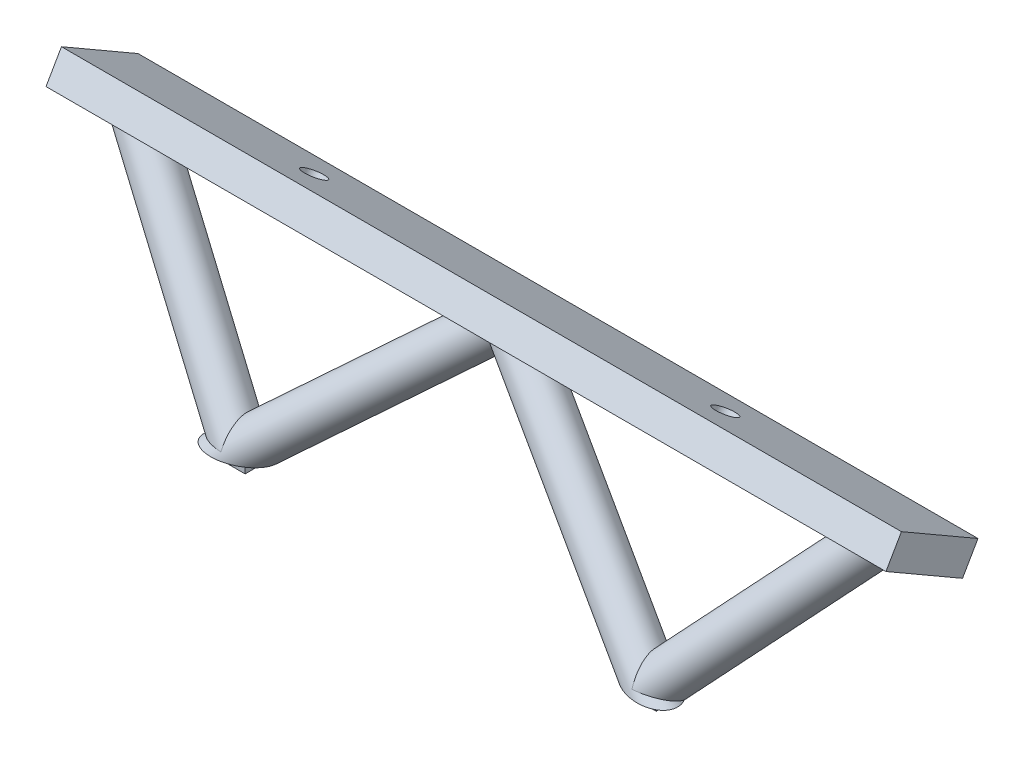
ISO-10303-21;
HEADER;
FILE_DESCRIPTION(('STEP AP214'),'2;1');
FILE_NAME('part.step','',(''),(''),'','','');
FILE_SCHEMA(('AUTOMOTIVE_DESIGN { 1 0 10303 214 1 1 1 1 }'));
ENDSEC;
DATA;
#1=APPLICATION_CONTEXT('core data for automotive mechanical design processes');
#2=APPLICATION_PROTOCOL_DEFINITION('international standard','automotive_design',2000,#1);
#3=PRODUCT_CONTEXT('',#1,'mechanical');
#4=PRODUCT('Part','Part','',(#3));
#5=PRODUCT_RELATED_PRODUCT_CATEGORY('part','',(#4));
#6=PRODUCT_DEFINITION_FORMATION('','',#4);
#7=PRODUCT_DEFINITION_CONTEXT('part definition',#1,'design');
#8=PRODUCT_DEFINITION('design','',#6,#7);
#9=PRODUCT_DEFINITION_SHAPE('','',#8);
#10=(LENGTH_UNIT() NAMED_UNIT(*) SI_UNIT(.MILLI.,.METRE.));
#11=(NAMED_UNIT(*) PLANE_ANGLE_UNIT() SI_UNIT($,.RADIAN.));
#12=(NAMED_UNIT(*) SI_UNIT($,.STERADIAN.) SOLID_ANGLE_UNIT());
#13=UNCERTAINTY_MEASURE_WITH_UNIT(LENGTH_MEASURE(1.E-05),#10,'distance_accuracy_value','');
#14=(GEOMETRIC_REPRESENTATION_CONTEXT(3) GLOBAL_UNCERTAINTY_ASSIGNED_CONTEXT((#13)) GLOBAL_UNIT_ASSIGNED_CONTEXT((#10,
#11,#12)) REPRESENTATION_CONTEXT('',''));
#15=CARTESIAN_POINT('',(0.,0.,0.));
#16=DIRECTION('',(0.,0.,1.));
#17=DIRECTION('',(1.,0.,0.));
#18=AXIS2_PLACEMENT_3D('',#15,#16,#17);
#19=CARTESIAN_POINT('',(58.,55.2139289628746,53.));
#20=DIRECTION('',(0.,1.,0.));
#21=DIRECTION('',(-1.,0.,0.));
#22=AXIS2_PLACEMENT_3D('',#19,#20,#21);
#23=PLANE('',#22);
#24=CARTESIAN_POINT('',(46.5,55.2139289628746,43.));
#25=DIRECTION('',(0.,1.,0.));
#26=DIRECTION('',(-0.953957033947419,0.,-0.299943290277083));
#27=AXIS2_PLACEMENT_3D('',#24,#25,#26);
#28=ELLIPSE('',#27,7.27687672687006,4.74999999999999);
#29=CARTESIAN_POINT('',(46.4242656035113,55.2139289628746,38.1095741940705));
#30=VERTEX_POINT('',#29);
#31=CARTESIAN_POINT('',(52.9386609054862,55.2139289628746,42.0774517850268));
#32=VERTEX_POINT('',#31);
#33=EDGE_CURVE('E204',#30,#32,#28,.T.);
#34=ORIENTED_EDGE('',*,*,#33,.F.);
#35=CARTESIAN_POINT('',(46.5,55.2139289628746,43.));
#36=DIRECTION('',(0.,1.,0.));
#37=DIRECTION('',(0.934859867697559,0.,-0.355016940114838));
#38=AXIS2_PLACEMENT_3D('',#35,#36,#37);
#39=ELLIPSE('',#38,6.65247116038743,4.74999999999999);
#40=EDGE_CURVE('E245',#32,#30,#39,.T.);
#41=ORIENTED_EDGE('',*,*,#40,.F.);
#42=EDGE_LOOP('',(#34,#41));
#43=FACE_BOUND('',#42,.T.);
#44=DIRECTION('',(0.,0.,1.));
#45=VECTOR('',#44,1.);
#46=CARTESIAN_POINT('',(49.,55.2139289628746,44.5));
#47=LINE('',#46,#45);
#48=CARTESIAN_POINT('',(49.,55.2139289628746,41.5));
#49=VERTEX_POINT('',#48);
#50=CARTESIAN_POINT('',(49.,55.2139289628746,44.5));
#51=VERTEX_POINT('',#50);
#52=EDGE_CURVE('E49',#49,#51,#47,.T.);
#53=ORIENTED_EDGE('',*,*,#52,.F.);
#54=DIRECTION('',(1.,0.,0.));
#55=VECTOR('',#54,1.);
#56=CARTESIAN_POINT('',(44.,55.2139289628746,41.5));
#57=LINE('',#56,#55);
#58=CARTESIAN_POINT('',(44.,55.2139289628746,41.5));
#59=VERTEX_POINT('',#58);
#60=EDGE_CURVE('E53',#59,#49,#57,.T.);
#61=ORIENTED_EDGE('',*,*,#60,.F.);
#62=DIRECTION('',(0.,0.,-1.));
#63=VECTOR('',#62,1.);
#64=CARTESIAN_POINT('',(44.,55.2139289628746,44.5));
#65=LINE('',#64,#63);
#66=CARTESIAN_POINT('',(44.,55.2139289628746,44.5));
#67=VERTEX_POINT('',#66);
#68=EDGE_CURVE('E584',#67,#59,#65,.T.);
#69=ORIENTED_EDGE('',*,*,#68,.F.);
#70=DIRECTION('',(-1.,0.,0.));
#71=VECTOR('',#70,1.);
#72=CARTESIAN_POINT('',(44.,55.2139289628746,44.5));
#73=LINE('',#72,#71);
#74=EDGE_CURVE('E586',#51,#67,#73,.T.);
#75=ORIENTED_EDGE('',*,*,#74,.F.);
#76=EDGE_LOOP('',(#53,#61,#69,#75));
#77=FACE_BOUND('',#76,.T.);
#78=ADVANCED_FACE('F34',(#43,#77),#23,.F.);
#79=CARTESIAN_POINT('',(-46.5,55.2139289628746,43.));
#80=DIRECTION('',(0.,1.,0.));
#81=DIRECTION('',(0.953957033947419,0.,-0.299943290277083));
#82=AXIS2_PLACEMENT_3D('',#79,#80,#81);
#83=ELLIPSE('',#82,7.27687672687007,4.75);
#84=CARTESIAN_POINT('',(-52.9386609054863,55.2139289628746,42.0774517850268));
#85=VERTEX_POINT('',#84);
#86=CARTESIAN_POINT('',(-46.4242656035112,55.2139289628746,38.1095741940705));
#87=VERTEX_POINT('',#86);
#88=EDGE_CURVE('E211',#85,#87,#83,.T.);
#89=ORIENTED_EDGE('',*,*,#88,.F.);
#90=CARTESIAN_POINT('',(-46.5,55.2139289628746,43.));
#91=DIRECTION('',(0.,1.,0.));
#92=DIRECTION('',(-0.93485986769756,0.,-0.355016940114836));
#93=AXIS2_PLACEMENT_3D('',#90,#91,#92);
#94=ELLIPSE('',#93,6.65247116038745,4.75);
#95=EDGE_CURVE('E224',#87,#85,#94,.T.);
#96=ORIENTED_EDGE('',*,*,#95,.F.);
#97=EDGE_LOOP('',(#89,#96));
#98=FACE_BOUND('',#97,.T.);
#99=DIRECTION('',(0.,0.,1.));
#100=VECTOR('',#99,1.);
#101=CARTESIAN_POINT('',(-44.,55.2139289628746,44.5));
#102=LINE('',#101,#100);
#103=CARTESIAN_POINT('',(-44.,55.2139289628746,41.5));
#104=VERTEX_POINT('',#103);
#105=CARTESIAN_POINT('',(-44.,55.2139289628746,44.5));
#106=VERTEX_POINT('',#105);
#107=EDGE_CURVE('E166',#104,#106,#102,.T.);
#108=ORIENTED_EDGE('',*,*,#107,.F.);
#109=DIRECTION('',(1.,0.,0.));
#110=VECTOR('',#109,1.);
#111=CARTESIAN_POINT('',(-49.,55.2139289628746,41.5));
#112=LINE('',#111,#110);
#113=CARTESIAN_POINT('',(-49.,55.2139289628746,41.5));
#114=VERTEX_POINT('',#113);
#115=EDGE_CURVE('E179',#114,#104,#112,.T.);
#116=ORIENTED_EDGE('',*,*,#115,.F.);
#117=DIRECTION('',(0.,0.,-1.));
#118=VECTOR('',#117,1.);
#119=CARTESIAN_POINT('',(-49.,55.2139289628746,44.5));
#120=LINE('',#119,#118);
#121=CARTESIAN_POINT('',(-49.,55.2139289628746,44.5));
#122=VERTEX_POINT('',#121);
#123=EDGE_CURVE('E188',#122,#114,#120,.T.);
#124=ORIENTED_EDGE('',*,*,#123,.F.);
#125=DIRECTION('',(-1.,0.,0.));
#126=VECTOR('',#125,1.);
#127=CARTESIAN_POINT('',(-49.,55.2139289628746,44.5));
#128=LINE('',#127,#126);
#129=EDGE_CURVE('E169',#106,#122,#128,.T.);
#130=ORIENTED_EDGE('',*,*,#129,.F.);
#131=EDGE_LOOP('',(#108,#116,#124,#130));
#132=FACE_BOUND('',#131,.T.);
#133=ADVANCED_FACE('F317',(#98,#132),#23,.F.);
#134=CARTESIAN_POINT('',(0.,64.0858798800484,-37.0000000000001));
#135=DIRECTION('',(0.,0.866025403784438,-0.500000000000001));
#136=DIRECTION('',(0.,0.500000000000001,0.866025403784438));
#137=AXIS2_PLACEMENT_3D('',#134,#135,#136);
#138=PLANE('',#137);
#139=CARTESIAN_POINT('',(-46.5,100.678030578012,26.3794641670904));
#140=DIRECTION('',(0.,0.866025403784438,-0.500000000000001));
#141=DIRECTION('',(0.,0.500000000000001,0.866025403784438));
#142=AXIS2_PLACEMENT_3D('',#139,#140,#141);
#143=CIRCLE('',#142,2.50000000000001);
#144=CARTESIAN_POINT('',(-46.5,101.928030578012,28.5445276765515));
#145=VERTEX_POINT('',#144);
#146=EDGE_CURVE('E603',#145,#145,#143,.F.);
#147=ORIENTED_EDGE('',*,*,#146,.T.);
#148=EDGE_LOOP('',(#147));
#149=FACE_BOUND('',#148,.T.);
#150=CARTESIAN_POINT('',(46.5,100.678030578012,26.3794641670904));
#151=DIRECTION('',(0.,0.866025403784438,-0.500000000000001));
#152=DIRECTION('',(0.,0.500000000000001,0.866025403784438));
#153=AXIS2_PLACEMENT_3D('',#150,#151,#152);
#154=CIRCLE('',#153,2.50000000000001);
#155=CARTESIAN_POINT('',(46.5,101.928030578012,28.5445276765515));
#156=VERTEX_POINT('',#155);
#157=EDGE_CURVE('E597',#156,#156,#154,.F.);
#158=ORIENTED_EDGE('',*,*,#157,.T.);
#159=EDGE_LOOP('',(#158));
#160=FACE_BOUND('',#159,.T.);
#161=DIRECTION('',(1.,0.,0.));
#162=VECTOR('',#161,1.);
#163=CARTESIAN_POINT('',(0.,95.6780305780125,17.719210129246));
#164=LINE('',#163,#162);
#165=CARTESIAN_POINT('',(-95.,95.6780305780125,17.719210129246));
#166=VERTEX_POINT('',#165);
#167=CARTESIAN_POINT('',(95.,95.6780305780125,17.719210129246));
#168=VERTEX_POINT('',#167);
#169=EDGE_CURVE('E260',#166,#168,#164,.T.);
#170=ORIENTED_EDGE('',*,*,#169,.F.);
#171=DIRECTION('',(0.,0.500000000000001,0.866025403784438));
#172=VECTOR('',#171,1.);
#173=CARTESIAN_POINT('',(-95.,64.0858798800484,-37.0000000000001));
#174=LINE('',#173,#172);
#175=CARTESIAN_POINT('',(-95.0000000000001,105.678030578012,35.0397182049348));
#176=VERTEX_POINT('',#175);
#177=EDGE_CURVE('E230',#166,#176,#174,.T.);
#178=ORIENTED_EDGE('',*,*,#177,.T.);
#179=DIRECTION('',(1.,0.,0.));
#180=VECTOR('',#179,1.);
#181=CARTESIAN_POINT('',(0.,105.678030578012,35.0397182049348));
#182=LINE('',#181,#180);
#183=CARTESIAN_POINT('',(95.,105.678030578012,35.0397182049348));
#184=VERTEX_POINT('',#183);
#185=EDGE_CURVE('E254',#176,#184,#182,.T.);
#186=ORIENTED_EDGE('',*,*,#185,.T.);
#187=DIRECTION('',(0.,0.500000000000001,0.866025403784438));
#188=VECTOR('',#187,1.);
#189=CARTESIAN_POINT('',(95.,64.0858798800484,-37.0000000000001));
#190=LINE('',#189,#188);
#191=EDGE_CURVE('E257',#168,#184,#190,.T.);
#192=ORIENTED_EDGE('',*,*,#191,.F.);
#193=EDGE_LOOP('',(#170,#178,#186,#192));
#194=FACE_BOUND('',#193,.T.);
#195=ADVANCED_FACE('F279',(#149,#160,#194),#138,.T.);
#196=CARTESIAN_POINT('',(95.,58.0237020535574,-33.5000000000001));
#197=DIRECTION('',(-1.,0.,0.));
#198=DIRECTION('',(0.,0.,1.));
#199=AXIS2_PLACEMENT_3D('',#196,#197,#198);
#200=PLANE('',#199);
#201=DIRECTION('',(0.,0.866025403784438,-0.500000000000001));
#202=VECTOR('',#201,1.);
#203=CARTESIAN_POINT('',(95.,89.6158527515214,21.2192101292461));
#204=LINE('',#203,#202);
#205=CARTESIAN_POINT('',(95.,89.6158527515214,21.2192101292461));
#206=VERTEX_POINT('',#205);
#207=EDGE_CURVE('E11',#206,#168,#204,.T.);
#208=ORIENTED_EDGE('',*,*,#207,.T.);
#209=ORIENTED_EDGE('',*,*,#191,.T.);
#210=DIRECTION('',(0.,0.866025403784438,-0.500000000000001));
#211=VECTOR('',#210,1.);
#212=CARTESIAN_POINT('',(95.,99.6158527515214,38.5397182049348));
#213=LINE('',#212,#211);
#214=CARTESIAN_POINT('',(95.,99.6158527515214,38.5397182049348));
#215=VERTEX_POINT('',#214);
#216=EDGE_CURVE('E38',#215,#184,#213,.T.);
#217=ORIENTED_EDGE('',*,*,#216,.F.);
#218=DIRECTION('',(0.,0.500000000000001,0.866025403784438));
#219=VECTOR('',#218,1.);
#220=CARTESIAN_POINT('',(95.,58.0237020535574,-33.5000000000001));
#221=LINE('',#220,#219);
#222=EDGE_CURVE('E266',#206,#215,#221,.T.);
#223=ORIENTED_EDGE('',*,*,#222,.F.);
#224=EDGE_LOOP('',(#208,#209,#217,#223));
#225=FACE_BOUND('',#224,.T.);
#226=ADVANCED_FACE('F281',(#225),#200,.F.);
#227=CARTESIAN_POINT('',(0.,89.6158527515214,21.2192101292461));
#228=DIRECTION('',(0.,0.500000000000001,0.866025403784438));
#229=DIRECTION('',(0.,-0.866025403784438,0.500000000000001));
#230=AXIS2_PLACEMENT_3D('',#227,#228,#229);
#231=PLANE('',#230);
#232=DIRECTION('',(1.,0.,0.));
#233=VECTOR('',#232,1.);
#234=CARTESIAN_POINT('',(0.,89.6158527515214,21.2192101292461));
#235=LINE('',#234,#233);
#236=CARTESIAN_POINT('',(-95.,89.6158527515214,21.2192101292461));
#237=VERTEX_POINT('',#236);
#238=EDGE_CURVE('E268',#237,#206,#235,.T.);
#239=ORIENTED_EDGE('',*,*,#238,.F.);
#240=DIRECTION('',(0.,0.866025403784438,-0.500000000000001));
#241=VECTOR('',#240,1.);
#242=CARTESIAN_POINT('',(-95.,89.6158527515214,21.2192101292461));
#243=LINE('',#242,#241);
#244=EDGE_CURVE('E236',#237,#166,#243,.T.);
#245=ORIENTED_EDGE('',*,*,#244,.T.);
#246=ORIENTED_EDGE('',*,*,#169,.T.);
#247=ORIENTED_EDGE('',*,*,#207,.F.);
#248=EDGE_LOOP('',(#239,#245,#246,#247));
#249=FACE_BOUND('',#248,.T.);
#250=ADVANCED_FACE('F283',(#249),#231,.F.);
#251=CARTESIAN_POINT('',(-95.,58.0237020535573,-33.5000000000001));
#252=DIRECTION('',(-1.,0.,0.));
#253=DIRECTION('',(0.,0.,1.));
#254=AXIS2_PLACEMENT_3D('',#251,#252,#253);
#255=PLANE('',#254);
#256=DIRECTION('',(0.,0.866025403784438,-0.500000000000001));
#257=VECTOR('',#256,1.);
#258=CARTESIAN_POINT('',(-95.0000000000001,99.6158527515214,38.5397182049348));
#259=LINE('',#258,#257);
#260=CARTESIAN_POINT('',(-95.0000000000001,99.6158527515214,38.5397182049348));
#261=VERTEX_POINT('',#260);
#262=EDGE_CURVE('E237',#261,#176,#259,.T.);
#263=ORIENTED_EDGE('',*,*,#262,.T.);
#264=ORIENTED_EDGE('',*,*,#177,.F.);
#265=ORIENTED_EDGE('',*,*,#244,.F.);
#266=DIRECTION('',(0.,0.500000000000001,0.866025403784438));
#267=VECTOR('',#266,1.);
#268=CARTESIAN_POINT('',(-95.,58.0237020535573,-33.5000000000001));
#269=LINE('',#268,#267);
#270=EDGE_CURVE('E233',#237,#261,#269,.T.);
#271=ORIENTED_EDGE('',*,*,#270,.T.);
#272=EDGE_LOOP('',(#263,#264,#265,#271));
#273=FACE_BOUND('',#272,.T.);
#274=ADVANCED_FACE('F286',(#273),#255,.T.);
#275=CARTESIAN_POINT('',(0.,99.6158527515214,38.5397182049348));
#276=DIRECTION('',(0.,0.500000000000001,0.866025403784438));
#277=DIRECTION('',(0.,-0.866025403784438,0.500000000000001));
#278=AXIS2_PLACEMENT_3D('',#275,#276,#277);
#279=PLANE('',#278);
#280=ORIENTED_EDGE('',*,*,#216,.T.);
#281=ORIENTED_EDGE('',*,*,#185,.F.);
#282=ORIENTED_EDGE('',*,*,#262,.F.);
#283=DIRECTION('',(1.,0.,0.));
#284=VECTOR('',#283,1.);
#285=CARTESIAN_POINT('',(0.,99.6158527515214,38.5397182049348));
#286=LINE('',#285,#284);
#287=EDGE_CURVE('E263',#261,#215,#286,.T.);
#288=ORIENTED_EDGE('',*,*,#287,.T.);
#289=EDGE_LOOP('',(#280,#281,#282,#288));
#290=FACE_BOUND('',#289,.T.);
#291=ADVANCED_FACE('F36',(#290),#279,.T.);
#292=CARTESIAN_POINT('',(0.,58.0237020535574,-33.5000000000001));
#293=DIRECTION('',(0.,0.866025403784438,-0.500000000000001));
#294=DIRECTION('',(0.,0.500000000000001,0.866025403784438));
#295=AXIS2_PLACEMENT_3D('',#292,#293,#294);
#296=PLANE('',#295);
#297=CARTESIAN_POINT('',(-46.5,94.6158527515214,29.8794641670904));
#298=DIRECTION('',(0.,-0.866025403784438,0.500000000000001));
#299=DIRECTION('',(0.,-0.500000000000001,-0.866025403784438));
#300=AXIS2_PLACEMENT_3D('',#297,#298,#299);
#301=CIRCLE('',#300,2.50000000000001);
#302=CARTESIAN_POINT('',(-46.5,93.3658527515214,27.7144006576293));
#303=VERTEX_POINT('',#302);
#304=EDGE_CURVE('E594',#303,#303,#301,.T.);
#305=ORIENTED_EDGE('',*,*,#304,.F.);
#306=EDGE_LOOP('',(#305));
#307=FACE_BOUND('',#306,.T.);
#308=CARTESIAN_POINT('',(46.5,94.6158527515214,29.8794641670904));
#309=DIRECTION('',(0.,-0.866025403784438,0.500000000000001));
#310=DIRECTION('',(0.,-0.500000000000001,-0.866025403784438));
#311=AXIS2_PLACEMENT_3D('',#308,#309,#310);
#312=CIRCLE('',#311,2.50000000000001);
#313=CARTESIAN_POINT('',(46.5,93.3658527515214,27.7144006576293));
#314=VERTEX_POINT('',#313);
#315=EDGE_CURVE('E600',#314,#314,#312,.T.);
#316=ORIENTED_EDGE('',*,*,#315,.F.);
#317=EDGE_LOOP('',(#316));
#318=FACE_BOUND('',#317,.T.);
#319=CARTESIAN_POINT('',(82.3559710967707,94.3295337957156,29.3835451884648));
#320=DIRECTION('',(0.,0.866025403784438,-0.500000000000001));
#321=DIRECTION('',(-0.977341114798957,-0.105835184749133,-0.183311917213937));
#322=AXIS2_PLACEMENT_3D('',#319,#320,#321);
#323=ELLIPSE('',#322,6.39611855489561,4.74999999999999);
#324=CARTESIAN_POINT('',(76.1047814579428,93.6525994067809,28.2110604334392));
#325=VERTEX_POINT('',#324);
#326=EDGE_CURVE('E251',#325,#325,#323,.F.);
#327=ORIENTED_EDGE('',*,*,#326,.F.);
#328=EDGE_LOOP('',(#327));
#329=FACE_BOUND('',#328,.T.);
#330=ORIENTED_EDGE('',*,*,#287,.F.);
#331=ORIENTED_EDGE('',*,*,#270,.F.);
#332=ORIENTED_EDGE('',*,*,#238,.T.);
#333=ORIENTED_EDGE('',*,*,#222,.T.);
#334=EDGE_LOOP('',(#330,#331,#332,#333));
#335=FACE_BOUND('',#334,.T.);
#336=CARTESIAN_POINT('',(-82.3559710967709,94.3295337957156,29.3835451884648));
#337=DIRECTION('',(0.,0.866025403784438,-0.500000000000001));
#338=DIRECTION('',(0.977341114798957,-0.105835184749133,-0.183311917213937));
#339=AXIS2_PLACEMENT_3D('',#336,#337,#338);
#340=ELLIPSE('',#339,6.39611855489563,4.75);
#341=CARTESIAN_POINT('',(-76.1047814579429,93.6525994067809,28.2110604334392));
#342=VERTEX_POINT('',#341);
#343=EDGE_CURVE('E227',#342,#342,#340,.F.);
#344=ORIENTED_EDGE('',*,*,#343,.F.);
#345=EDGE_LOOP('',(#344));
#346=FACE_BOUND('',#345,.T.);
#347=CARTESIAN_POINT('',(3.19343750649756,94.3295337957156,29.3835451884647));
#348=DIRECTION('',(0.,0.866025403784438,-0.500000000000001));
#349=DIRECTION('',(0.984300305855036,-0.0882509318558194,-0.152855097789578));
#350=AXIS2_PLACEMENT_3D('',#347,#348,#349);
#351=ELLIPSE('',#350,6.99646268766552,4.74999999999999);
#352=CARTESIAN_POINT('',(0.,92.3552803187094,25.9640378592704));
#353=VERTEX_POINT('',#352);
#354=CARTESIAN_POINT('',(1.38561037643647E-13,96.6079738023079,33.3299190418801));
#355=VERTEX_POINT('',#354);
#356=EDGE_CURVE('E207',#353,#355,#351,.F.);
#357=ORIENTED_EDGE('',*,*,#356,.F.);
#358=CARTESIAN_POINT('',(-3.19343750649758,94.3295337957156,29.3835451884648));
#359=DIRECTION('',(0.,0.866025403784438,-0.500000000000001));
#360=DIRECTION('',(-0.984300305855036,-0.0882509318558198,-0.152855097789578));
#361=AXIS2_PLACEMENT_3D('',#358,#359,#360);
#362=ELLIPSE('',#361,6.99646268766554,4.75);
#363=EDGE_CURVE('E210',#355,#353,#362,.F.);
#364=ORIENTED_EDGE('',*,*,#363,.F.);
#365=EDGE_LOOP('',(#357,#364));
#366=FACE_BOUND('',#365,.T.);
#367=ADVANCED_FACE('F287',(#307,#318,#329,#335,#346,#366),#296,.F.);
#368=CARTESIAN_POINT('',(92.1573453599017,105.021942082768,25.6614323670138));
#369=DIRECTION('',(-0.654518683612461,-0.714020382122688,0.248556204339345));
#370=DIRECTION('',(0.737154140200743,-0.675724628517345,0.));
#371=AXIS2_PLACEMENT_3D('',#368,#369,#370);
#372=CYLINDRICAL_SURFACE('',#371,4.74999999999999);
#373=ORIENTED_EDGE('',*,*,#326,.T.);
#374=EDGE_LOOP('',(#373));
#375=FACE_BOUND('',#374,.T.);
#376=ORIENTED_EDGE('',*,*,#40,.T.);
#377=CARTESIAN_POINT('',(46.5,55.2139289628746,43.));
#378=DIRECTION('',(0.998892387096748,0.0444376617209511,-0.0154691053695681));
#379=DIRECTION('',(-0.0470531507995,0.943368111151235,-0.328393982683591));
#380=AXIS2_PLACEMENT_3D('',#377,#378,#379);
#381=ELLIPSE('',#380,6.89036846413452,4.74999999999999);
#382=CARTESIAN_POINT('',(46.5,56.7755300301135,47.4859672431705));
#383=VERTEX_POINT('',#382);
#384=EDGE_CURVE('E248',#30,#383,#381,.T.);
#385=ORIENTED_EDGE('',*,*,#384,.T.);
#386=CARTESIAN_POINT('',(46.5,55.2139289628746,43.));
#387=DIRECTION('',(-0.0470531507995,0.943368111151235,-0.328393982683591));
#388=DIRECTION('',(0.998892387096748,0.0444376617209511,-0.0154691053695681));
#389=AXIS2_PLACEMENT_3D('',#386,#387,#388);
#390=ELLIPSE('',#389,6.55704887087197,4.74999999999999);
#391=EDGE_CURVE('E240',#383,#32,#390,.T.);
#392=ORIENTED_EDGE('',*,*,#391,.T.);
#393=EDGE_LOOP('',(#376,#385,#392));
#394=FACE_BOUND('',#393,.T.);
#395=ADVANCED_FACE('F290',(#375,#394),#372,.T.);
#396=CARTESIAN_POINT('',(-8.12337828683931,104.551173867117,25.8253105471546));
#397=DIRECTION('',(0.722690347633596,-0.652752572056153,0.227228389756449));
#398=DIRECTION('',(0.670286257968771,0.742102642751138,0.));
#399=AXIS2_PLACEMENT_3D('',#396,#397,#398);
#400=CYLINDRICAL_SURFACE('',#399,4.74999999999999);
#401=ORIENTED_EDGE('',*,*,#33,.T.);
#402=ORIENTED_EDGE('',*,*,#391,.F.);
#403=ORIENTED_EDGE('',*,*,#384,.F.);
#404=EDGE_LOOP('',(#401,#402,#403));
#405=FACE_BOUND('',#404,.T.);
#406=CARTESIAN_POINT('',(0.,97.2139289628747,28.3794641670904));
#407=DIRECTION('',(-1.,0.,0.));
#408=DIRECTION('',(0.,-0.94441415645694,0.328758119418708));
#409=AXIS2_PLACEMENT_3D('',#406,#407,#408);
#410=ELLIPSE('',#409,6.5726628500762,4.75);
#411=EDGE_CURVE('E215',#355,#353,#410,.F.);
#412=ORIENTED_EDGE('',*,*,#411,.T.);
#413=ORIENTED_EDGE('',*,*,#356,.T.);
#414=EDGE_LOOP('',(#412,#413));
#415=FACE_BOUND('',#414,.T.);
#416=ADVANCED_FACE('F298',(#405,#415),#400,.T.);
#417=CARTESIAN_POINT('',(-92.1573453599018,105.021942082768,25.6614323670138));
#418=DIRECTION('',(0.654518683612462,-0.714020382122687,0.248556204339344));
#419=DIRECTION('',(0.737154140200742,0.675724628517346,0.));
#420=AXIS2_PLACEMENT_3D('',#417,#418,#419);
#421=CYLINDRICAL_SURFACE('',#420,4.75);
#422=ORIENTED_EDGE('',*,*,#343,.T.);
#423=EDGE_LOOP('',(#422));
#424=FACE_BOUND('',#423,.T.);
#425=CARTESIAN_POINT('',(-46.5,55.2139289628746,43.));
#426=DIRECTION('',(0.0470531507994994,0.943368111151235,-0.32839398268359));
#427=DIRECTION('',(-0.998892387096748,0.0444376617209503,-0.0154691053695679));
#428=AXIS2_PLACEMENT_3D('',#425,#426,#427);
#429=ELLIPSE('',#428,6.55704887087199,4.75);
#430=CARTESIAN_POINT('',(-46.5,56.7755300301135,47.4859672431705));
#431=VERTEX_POINT('',#430);
#432=EDGE_CURVE('E221',#85,#431,#429,.T.);
#433=ORIENTED_EDGE('',*,*,#432,.T.);
#434=CARTESIAN_POINT('',(-46.5,55.2139289628746,43.));
#435=DIRECTION('',(-0.998892387096748,0.0444376617209503,-0.0154691053695679));
#436=DIRECTION('',(0.0470531507994994,0.943368111151235,-0.32839398268359));
#437=AXIS2_PLACEMENT_3D('',#434,#435,#436);
#438=ELLIPSE('',#437,6.89036846413453,4.75);
#439=EDGE_CURVE('E214',#431,#87,#438,.T.);
#440=ORIENTED_EDGE('',*,*,#439,.T.);
#441=ORIENTED_EDGE('',*,*,#95,.T.);
#442=EDGE_LOOP('',(#433,#440,#441));
#443=FACE_BOUND('',#442,.T.);
#444=ADVANCED_FACE('F303',(#424,#443),#421,.T.);
#445=CARTESIAN_POINT('',(23.5321547775089,118.468778439334,20.9804811100982));
#446=DIRECTION('',(-0.722690347633596,-0.652752572056153,0.227228389756448));
#447=DIRECTION('',(0.670286257968771,-0.742102642751138,0.));
#448=AXIS2_PLACEMENT_3D('',#445,#446,#447);
#449=CYLINDRICAL_SURFACE('',#448,4.75);
#450=ORIENTED_EDGE('',*,*,#439,.F.);
#451=ORIENTED_EDGE('',*,*,#432,.F.);
#452=ORIENTED_EDGE('',*,*,#88,.T.);
#453=EDGE_LOOP('',(#450,#451,#452));
#454=FACE_BOUND('',#453,.T.);
#455=ORIENTED_EDGE('',*,*,#363,.T.);
#456=ORIENTED_EDGE('',*,*,#411,.F.);
#457=EDGE_LOOP('',(#455,#456));
#458=FACE_BOUND('',#457,.T.);
#459=ADVANCED_FACE('F300',(#454,#458),#449,.T.);
#460=CARTESIAN_POINT('',(-44.,52.2139289628746,44.5));
#461=DIRECTION('',(-1.,0.,0.));
#462=DIRECTION('',(0.,-1.,0.));
#463=AXIS2_PLACEMENT_3D('',#460,#461,#462);
#464=PLANE('',#463);
#465=ORIENTED_EDGE('',*,*,#107,.T.);
#466=DIRECTION('',(0.,1.,0.));
#467=VECTOR('',#466,1.);
#468=CARTESIAN_POINT('',(-44.,52.2139289628746,44.5));
#469=LINE('',#468,#467);
#470=CARTESIAN_POINT('',(-44.,52.2139289628746,44.5));
#471=VERTEX_POINT('',#470);
#472=EDGE_CURVE('E201',#471,#106,#469,.T.);
#473=ORIENTED_EDGE('',*,*,#472,.F.);
#474=DIRECTION('',(0.,0.,1.));
#475=VECTOR('',#474,1.);
#476=CARTESIAN_POINT('',(-44.,52.2139289628746,44.5));
#477=LINE('',#476,#475);
#478=CARTESIAN_POINT('',(-44.,52.2139289628746,41.5));
#479=VERTEX_POINT('',#478);
#480=EDGE_CURVE('E175',#479,#471,#477,.T.);
#481=ORIENTED_EDGE('',*,*,#480,.F.);
#482=DIRECTION('',(0.,1.,0.));
#483=VECTOR('',#482,1.);
#484=CARTESIAN_POINT('',(-44.,52.2139289628746,41.5));
#485=LINE('',#484,#483);
#486=EDGE_CURVE('E184',#479,#104,#485,.T.);
#487=ORIENTED_EDGE('',*,*,#486,.T.);
#488=EDGE_LOOP('',(#465,#473,#481,#487));
#489=FACE_BOUND('',#488,.T.);
#490=ADVANCED_FACE('F302',(#489),#464,.F.);
#491=CARTESIAN_POINT('',(-49.,52.2139289628746,44.5));
#492=DIRECTION('',(0.,0.,-1.));
#493=DIRECTION('',(0.,1.,0.));
#494=AXIS2_PLACEMENT_3D('',#491,#492,#493);
#495=PLANE('',#494);
#496=ORIENTED_EDGE('',*,*,#129,.T.);
#497=DIRECTION('',(0.,1.,0.));
#498=VECTOR('',#497,1.);
#499=CARTESIAN_POINT('',(-49.,52.2139289628746,44.5));
#500=LINE('',#499,#498);
#501=CARTESIAN_POINT('',(-49.,52.2139289628746,44.5));
#502=VERTEX_POINT('',#501);
#503=EDGE_CURVE('E198',#502,#122,#500,.T.);
#504=ORIENTED_EDGE('',*,*,#503,.F.);
#505=DIRECTION('',(-1.,0.,0.));
#506=VECTOR('',#505,1.);
#507=CARTESIAN_POINT('',(-49.,52.2139289628746,44.5));
#508=LINE('',#507,#506);
#509=EDGE_CURVE('E178',#471,#502,#508,.T.);
#510=ORIENTED_EDGE('',*,*,#509,.F.);
#511=ORIENTED_EDGE('',*,*,#472,.T.);
#512=EDGE_LOOP('',(#496,#504,#510,#511));
#513=FACE_BOUND('',#512,.T.);
#514=ADVANCED_FACE('F310',(#513),#495,.F.);
#515=CARTESIAN_POINT('',(-49.,52.2139289628746,44.5));
#516=DIRECTION('',(1.,0.,0.));
#517=DIRECTION('',(0.,1.,0.));
#518=AXIS2_PLACEMENT_3D('',#515,#516,#517);
#519=PLANE('',#518);
#520=ORIENTED_EDGE('',*,*,#123,.T.);
#521=DIRECTION('',(0.,1.,0.));
#522=VECTOR('',#521,1.);
#523=CARTESIAN_POINT('',(-49.,52.2139289628746,41.5));
#524=LINE('',#523,#522);
#525=CARTESIAN_POINT('',(-49.,52.2139289628746,41.5));
#526=VERTEX_POINT('',#525);
#527=EDGE_CURVE('E195',#526,#114,#524,.T.);
#528=ORIENTED_EDGE('',*,*,#527,.F.);
#529=DIRECTION('',(0.,0.,-1.));
#530=VECTOR('',#529,1.);
#531=CARTESIAN_POINT('',(-49.,52.2139289628746,44.5));
#532=LINE('',#531,#530);
#533=EDGE_CURVE('E181',#502,#526,#532,.T.);
#534=ORIENTED_EDGE('',*,*,#533,.F.);
#535=ORIENTED_EDGE('',*,*,#503,.T.);
#536=EDGE_LOOP('',(#520,#528,#534,#535));
#537=FACE_BOUND('',#536,.T.);
#538=ADVANCED_FACE('F425',(#537),#519,.F.);
#539=CARTESIAN_POINT('',(-49.,52.2139289628746,41.5));
#540=DIRECTION('',(0.,0.,1.));
#541=DIRECTION('',(1.,0.,0.));
#542=AXIS2_PLACEMENT_3D('',#539,#540,#541);
#543=PLANE('',#542);
#544=ORIENTED_EDGE('',*,*,#115,.T.);
#545=ORIENTED_EDGE('',*,*,#486,.F.);
#546=DIRECTION('',(1.,0.,0.));
#547=VECTOR('',#546,1.);
#548=CARTESIAN_POINT('',(-49.,52.2139289628746,41.5));
#549=LINE('',#548,#547);
#550=EDGE_CURVE('E183',#526,#479,#549,.T.);
#551=ORIENTED_EDGE('',*,*,#550,.F.);
#552=ORIENTED_EDGE('',*,*,#527,.T.);
#553=EDGE_LOOP('',(#544,#545,#551,#552));
#554=FACE_BOUND('',#553,.T.);
#555=ADVANCED_FACE('F421',(#554),#543,.F.);
#556=CARTESIAN_POINT('',(0.,52.2139289628746,0.));
#557=DIRECTION('',(0.,-1.,0.));
#558=DIRECTION('',(0.,0.,-1.));
#559=AXIS2_PLACEMENT_3D('',#556,#557,#558);
#560=PLANE('',#559);
#561=ORIENTED_EDGE('',*,*,#480,.T.);
#562=ORIENTED_EDGE('',*,*,#509,.T.);
#563=ORIENTED_EDGE('',*,*,#533,.T.);
#564=ORIENTED_EDGE('',*,*,#550,.T.);
#565=EDGE_LOOP('',(#561,#562,#563,#564));
#566=FACE_BOUND('',#565,.T.);
#567=ADVANCED_FACE('F418',(#566),#560,.T.);
#568=CARTESIAN_POINT('',(49.,52.2139289628746,44.5));
#569=DIRECTION('',(-1.,0.,0.));
#570=DIRECTION('',(0.,-1.,0.));
#571=AXIS2_PLACEMENT_3D('',#568,#569,#570);
#572=PLANE('',#571);
#573=ORIENTED_EDGE('',*,*,#52,.T.);
#574=DIRECTION('',(0.,1.,0.));
#575=VECTOR('',#574,1.);
#576=CARTESIAN_POINT('',(49.,52.2139289628746,44.5));
#577=LINE('',#576,#575);
#578=CARTESIAN_POINT('',(49.,52.2139289628746,44.5));
#579=VERTEX_POINT('',#578);
#580=EDGE_CURVE('E149',#579,#51,#577,.T.);
#581=ORIENTED_EDGE('',*,*,#580,.F.);
#582=DIRECTION('',(0.,0.,1.));
#583=VECTOR('',#582,1.);
#584=CARTESIAN_POINT('',(49.,52.2139289628746,44.5));
#585=LINE('',#584,#583);
#586=CARTESIAN_POINT('',(49.,52.2139289628746,41.5));
#587=VERTEX_POINT('',#586);
#588=EDGE_CURVE('E155',#587,#579,#585,.T.);
#589=ORIENTED_EDGE('',*,*,#588,.F.);
#590=DIRECTION('',(0.,1.,0.));
#591=VECTOR('',#590,1.);
#592=CARTESIAN_POINT('',(49.,52.2139289628746,41.5));
#593=LINE('',#592,#591);
#594=EDGE_CURVE('E588',#587,#49,#593,.T.);
#595=ORIENTED_EDGE('',*,*,#594,.T.);
#596=EDGE_LOOP('',(#573,#581,#589,#595));
#597=FACE_BOUND('',#596,.T.);
#598=ADVANCED_FACE('F165',(#597),#572,.F.);
#599=CARTESIAN_POINT('',(44.,52.2139289628746,44.5));
#600=DIRECTION('',(0.,0.,-1.));
#601=DIRECTION('',(-1.,0.,0.));
#602=AXIS2_PLACEMENT_3D('',#599,#600,#601);
#603=PLANE('',#602);
#604=ORIENTED_EDGE('',*,*,#74,.T.);
#605=DIRECTION('',(0.,1.,0.));
#606=VECTOR('',#605,1.);
#607=CARTESIAN_POINT('',(44.,52.2139289628746,44.5));
#608=LINE('',#607,#606);
#609=CARTESIAN_POINT('',(44.,52.2139289628746,44.5));
#610=VERTEX_POINT('',#609);
#611=EDGE_CURVE('E151',#610,#67,#608,.T.);
#612=ORIENTED_EDGE('',*,*,#611,.F.);
#613=DIRECTION('',(-1.,0.,0.));
#614=VECTOR('',#613,1.);
#615=CARTESIAN_POINT('',(44.,52.2139289628746,44.5));
#616=LINE('',#615,#614);
#617=EDGE_CURVE('E144',#579,#610,#616,.T.);
#618=ORIENTED_EDGE('',*,*,#617,.F.);
#619=ORIENTED_EDGE('',*,*,#580,.T.);
#620=EDGE_LOOP('',(#604,#612,#618,#619));
#621=FACE_BOUND('',#620,.T.);
#622=ADVANCED_FACE('F147',(#621),#603,.F.);
#623=CARTESIAN_POINT('',(44.,52.2139289628746,44.5));
#624=DIRECTION('',(1.,0.,0.));
#625=DIRECTION('',(0.,1.,0.));
#626=AXIS2_PLACEMENT_3D('',#623,#624,#625);
#627=PLANE('',#626);
#628=ORIENTED_EDGE('',*,*,#68,.T.);
#629=DIRECTION('',(0.,1.,0.));
#630=VECTOR('',#629,1.);
#631=CARTESIAN_POINT('',(44.,52.2139289628746,41.5));
#632=LINE('',#631,#630);
#633=CARTESIAN_POINT('',(44.,52.2139289628746,41.5));
#634=VERTEX_POINT('',#633);
#635=EDGE_CURVE('E171',#634,#59,#632,.T.);
#636=ORIENTED_EDGE('',*,*,#635,.F.);
#637=DIRECTION('',(0.,0.,-1.));
#638=VECTOR('',#637,1.);
#639=CARTESIAN_POINT('',(44.,52.2139289628746,44.5));
#640=LINE('',#639,#638);
#641=EDGE_CURVE('E154',#610,#634,#640,.T.);
#642=ORIENTED_EDGE('',*,*,#641,.F.);
#643=ORIENTED_EDGE('',*,*,#611,.T.);
#644=EDGE_LOOP('',(#628,#636,#642,#643));
#645=FACE_BOUND('',#644,.T.);
#646=ADVANCED_FACE('F409',(#645),#627,.F.);
#647=CARTESIAN_POINT('',(44.,52.2139289628746,41.5));
#648=DIRECTION('',(0.,0.,1.));
#649=DIRECTION('',(0.,-1.,0.));
#650=AXIS2_PLACEMENT_3D('',#647,#648,#649);
#651=PLANE('',#650);
#652=ORIENTED_EDGE('',*,*,#60,.T.);
#653=ORIENTED_EDGE('',*,*,#594,.F.);
#654=DIRECTION('',(1.,0.,0.));
#655=VECTOR('',#654,1.);
#656=CARTESIAN_POINT('',(44.,52.2139289628746,41.5));
#657=LINE('',#656,#655);
#658=EDGE_CURVE('E160',#634,#587,#657,.T.);
#659=ORIENTED_EDGE('',*,*,#658,.F.);
#660=ORIENTED_EDGE('',*,*,#635,.T.);
#661=EDGE_LOOP('',(#652,#653,#659,#660));
#662=FACE_BOUND('',#661,.T.);
#663=ADVANCED_FACE('F406',(#662),#651,.F.);
#664=CARTESIAN_POINT('',(0.,52.2139289628746,0.));
#665=DIRECTION('',(0.,-1.,0.));
#666=DIRECTION('',(0.,0.,-1.));
#667=AXIS2_PLACEMENT_3D('',#664,#665,#666);
#668=PLANE('',#667);
#669=ORIENTED_EDGE('',*,*,#588,.T.);
#670=ORIENTED_EDGE('',*,*,#617,.T.);
#671=ORIENTED_EDGE('',*,*,#641,.T.);
#672=ORIENTED_EDGE('',*,*,#658,.T.);
#673=EDGE_LOOP('',(#669,#670,#671,#672));
#674=FACE_BOUND('',#673,.T.);
#675=ADVANCED_FACE('F158',(#674),#668,.T.);
#676=CARTESIAN_POINT('',(46.5,108.179213590714,22.0486541354663));
#677=DIRECTION('',(0.,-0.866025403784438,0.500000000000001));
#678=DIRECTION('',(0.,-0.500000000000001,-0.866025403784438));
#679=AXIS2_PLACEMENT_3D('',#676,#677,#678);
#680=CYLINDRICAL_SURFACE('',#679,2.50000000000001);
#681=ORIENTED_EDGE('',*,*,#157,.F.);
#682=EDGE_LOOP('',(#681));
#683=FACE_BOUND('',#682,.T.);
#684=ORIENTED_EDGE('',*,*,#315,.T.);
#685=EDGE_LOOP('',(#684));
#686=FACE_BOUND('',#685,.T.);
#687=ADVANCED_FACE('F381',(#683,#686),#680,.F.);
#688=CARTESIAN_POINT('',(-46.5,108.179213590714,22.0486541354663));
#689=DIRECTION('',(0.,-0.866025403784438,0.500000000000001));
#690=DIRECTION('',(0.,-0.500000000000001,-0.866025403784438));
#691=AXIS2_PLACEMENT_3D('',#688,#689,#690);
#692=CYLINDRICAL_SURFACE('',#691,2.50000000000001);
#693=ORIENTED_EDGE('',*,*,#146,.F.);
#694=EDGE_LOOP('',(#693));
#695=FACE_BOUND('',#694,.T.);
#696=ORIENTED_EDGE('',*,*,#304,.T.);
#697=EDGE_LOOP('',(#696));
#698=FACE_BOUND('',#697,.T.);
#699=ADVANCED_FACE('F386',(#695,#698),#692,.F.);
#700=CLOSED_SHELL('',(#78,#133,#195,#226,#250,#274,#291,#367,#395,#416,#444,#459,#490,#514,#538,
#555,#567,#598,#622,#646,#663,#675,#687,#699));
#701=MANIFOLD_SOLID_BREP('B2',#700);
#702=ADVANCED_BREP_SHAPE_REPRESENTATION('',(#18,#701),#14);
#703=SHAPE_DEFINITION_REPRESENTATION(#9,#702);
ENDSEC;
END-ISO-10303-21;
